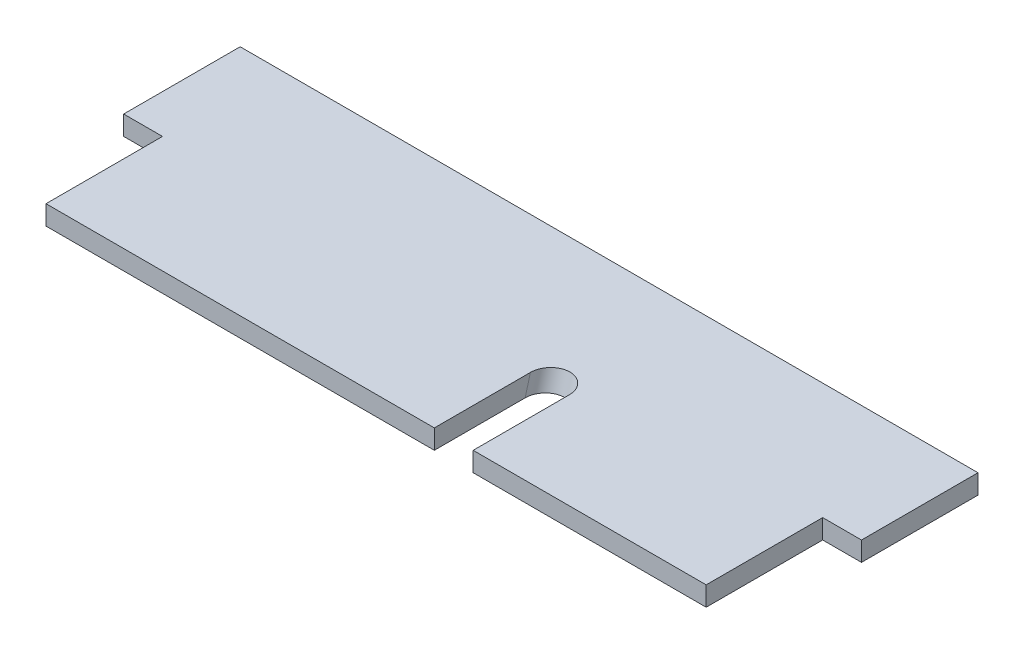
ISO-10303-21;
HEADER;
FILE_DESCRIPTION(('STEP AP214'),'2;1');
FILE_NAME('part.step','',(''),(''),'','','');
FILE_SCHEMA(('AUTOMOTIVE_DESIGN { 1 0 10303 214 1 1 1 1 }'));
ENDSEC;
DATA;
#1=APPLICATION_CONTEXT('core data for automotive mechanical design processes');
#2=APPLICATION_PROTOCOL_DEFINITION('international standard','automotive_design',2000,#1);
#3=PRODUCT_CONTEXT('',#1,'mechanical');
#4=PRODUCT('Part','Part','',(#3));
#5=PRODUCT_RELATED_PRODUCT_CATEGORY('part','',(#4));
#6=PRODUCT_DEFINITION_FORMATION('','',#4);
#7=PRODUCT_DEFINITION_CONTEXT('part definition',#1,'design');
#8=PRODUCT_DEFINITION('design','',#6,#7);
#9=PRODUCT_DEFINITION_SHAPE('','',#8);
#10=(LENGTH_UNIT() NAMED_UNIT(*) SI_UNIT(.MILLI.,.METRE.));
#11=(NAMED_UNIT(*) PLANE_ANGLE_UNIT() SI_UNIT($,.RADIAN.));
#12=(NAMED_UNIT(*) SI_UNIT($,.STERADIAN.) SOLID_ANGLE_UNIT());
#13=UNCERTAINTY_MEASURE_WITH_UNIT(LENGTH_MEASURE(1.E-05),#10,'distance_accuracy_value','');
#14=(GEOMETRIC_REPRESENTATION_CONTEXT(3) GLOBAL_UNCERTAINTY_ASSIGNED_CONTEXT((#13)) GLOBAL_UNIT_ASSIGNED_CONTEXT((#10,
#11,#12)) REPRESENTATION_CONTEXT('',''));
#15=CARTESIAN_POINT('',(0.,0.,0.));
#16=DIRECTION('',(0.,0.,1.));
#17=DIRECTION('',(1.,0.,0.));
#18=AXIS2_PLACEMENT_3D('',#15,#16,#17);
#19=CARTESIAN_POINT('',(-215.9,6.35,76.2));
#20=DIRECTION('',(0.,0.,-1.));
#21=DIRECTION('',(-1.,0.,0.));
#22=AXIS2_PLACEMENT_3D('',#19,#20,#21);
#23=PLANE('',#22);
#24=DIRECTION('',(1.,0.,0.));
#25=VECTOR('',#24,1.);
#26=CARTESIAN_POINT('',(-215.9,-6.35,76.2));
#27=LINE('',#26,#25);
#28=CARTESIAN_POINT('',(-215.9,-6.35,76.2));
#29=VERTEX_POINT('',#28);
#30=CARTESIAN_POINT('',(38.0999999999999,-6.35,76.2));
#31=VERTEX_POINT('',#30);
#32=EDGE_CURVE('E158',#29,#31,#27,.T.);
#33=ORIENTED_EDGE('',*,*,#32,.T.);
#34=DIRECTION('',(0.,-1.,0.));
#35=VECTOR('',#34,1.);
#36=CARTESIAN_POINT('',(38.0999999999999,6.34999999999999,76.2));
#37=LINE('',#36,#35);
#38=CARTESIAN_POINT('',(38.0999999999999,6.34999999999999,76.2));
#39=VERTEX_POINT('',#38);
#40=EDGE_CURVE('E262',#39,#31,#37,.T.);
#41=ORIENTED_EDGE('',*,*,#40,.F.);
#42=DIRECTION('',(1.,0.,0.));
#43=VECTOR('',#42,1.);
#44=CARTESIAN_POINT('',(-215.9,6.35,76.2));
#45=LINE('',#44,#43);
#46=CARTESIAN_POINT('',(-215.9,6.35,76.2));
#47=VERTEX_POINT('',#46);
#48=EDGE_CURVE('E52',#47,#39,#45,.T.);
#49=ORIENTED_EDGE('',*,*,#48,.F.);
#50=DIRECTION('',(0.,-1.,0.));
#51=VECTOR('',#50,1.);
#52=CARTESIAN_POINT('',(-215.9,6.35,76.2));
#53=LINE('',#52,#51);
#54=EDGE_CURVE('E152',#47,#29,#53,.T.);
#55=ORIENTED_EDGE('',*,*,#54,.T.);
#56=EDGE_LOOP('',(#33,#41,#49,#55));
#57=FACE_BOUND('',#56,.T.);
#58=ADVANCED_FACE('F42',(#57),#23,.F.);
#59=CARTESIAN_POINT('',(50.7999999999986,94.7896928963142,-10.6042856199856));
#60=DIRECTION('',(0.,-0.965182723476007,0.261576585923584));
#61=DIRECTION('',(0.,-0.261576585923584,-0.965182723476007));
#62=AXIS2_PLACEMENT_3D('',#59,#60,#61);
#63=CYLINDRICAL_SURFACE('',#62,12.7000000000001);
#64=CARTESIAN_POINT('',(50.7999999999986,6.34999999999999,13.363976933072));
#65=DIRECTION('',(0.,1.,0.));
#66=DIRECTION('',(0.,0.,1.));
#67=AXIS2_PLACEMENT_3D('',#64,#65,#66);
#68=ELLIPSE('',#67,13.1581302597941,12.7000000000001);
#69=CARTESIAN_POINT('',(38.0999999999992,6.34999999999999,13.363976933072));
#70=VERTEX_POINT('',#69);
#71=CARTESIAN_POINT('',(63.4999999999994,6.34999999999999,13.363976933072));
#72=VERTEX_POINT('',#71);
#73=EDGE_CURVE('E46',#70,#72,#68,.F.);
#74=ORIENTED_EDGE('',*,*,#73,.F.);
#75=DIRECTION('',(0.,-0.965182723476007,0.261576585923584));
#76=VECTOR('',#75,1.);
#77=CARTESIAN_POINT('',(38.0999999999992,94.7896928963142,-10.6042856199856));
#78=LINE('',#77,#76);
#79=CARTESIAN_POINT('',(38.0999999999985,-6.34999999999999,16.8058357235667));
#80=VERTEX_POINT('',#79);
#81=EDGE_CURVE('E131',#80,#70,#78,.F.);
#82=ORIENTED_EDGE('',*,*,#81,.F.);
#83=CARTESIAN_POINT('',(50.7999999999986,-6.34999999999999,16.8058357235667));
#84=DIRECTION('',(0.,1.,0.));
#85=DIRECTION('',(0.,0.,1.));
#86=AXIS2_PLACEMENT_3D('',#83,#84,#85);
#87=ELLIPSE('',#86,13.1581302597941,12.7000000000001);
#88=CARTESIAN_POINT('',(63.4999999999987,-6.34999999999999,16.8058357235667));
#89=VERTEX_POINT('',#88);
#90=EDGE_CURVE('E11',#80,#89,#87,.F.);
#91=ORIENTED_EDGE('',*,*,#90,.T.);
#92=DIRECTION('',(0.,-0.965182723476007,0.261576585923584));
#93=VECTOR('',#92,1.);
#94=CARTESIAN_POINT('',(63.4999999999994,94.7896928963142,-10.6042856199856));
#95=LINE('',#94,#93);
#96=EDGE_CURVE('E140',#89,#72,#95,.F.);
#97=ORIENTED_EDGE('',*,*,#96,.T.);
#98=EDGE_LOOP('',(#74,#82,#91,#97));
#99=FACE_BOUND('',#98,.T.);
#100=ADVANCED_FACE('F149',(#99),#63,.F.);
#101=CARTESIAN_POINT('',(215.9,6.35,0.));
#102=DIRECTION('',(-1.,0.,0.));
#103=DIRECTION('',(0.,0.,1.));
#104=AXIS2_PLACEMENT_3D('',#101,#102,#103);
#105=PLANE('',#104);
#106=DIRECTION('',(0.,0.,-1.));
#107=VECTOR('',#106,1.);
#108=CARTESIAN_POINT('',(215.9,-6.35,0.));
#109=LINE('',#108,#107);
#110=CARTESIAN_POINT('',(215.9,-6.35,76.2));
#111=VERTEX_POINT('',#110);
#112=CARTESIAN_POINT('',(215.9,-6.35,0.));
#113=VERTEX_POINT('',#112);
#114=EDGE_CURVE('E175',#111,#113,#109,.T.);
#115=ORIENTED_EDGE('',*,*,#114,.T.);
#116=DIRECTION('',(0.,-1.,0.));
#117=VECTOR('',#116,1.);
#118=CARTESIAN_POINT('',(215.9,6.35,0.));
#119=LINE('',#118,#117);
#120=CARTESIAN_POINT('',(215.9,6.35,0.));
#121=VERTEX_POINT('',#120);
#122=EDGE_CURVE('E197',#121,#113,#119,.T.);
#123=ORIENTED_EDGE('',*,*,#122,.F.);
#124=DIRECTION('',(0.,0.,-1.));
#125=VECTOR('',#124,1.);
#126=CARTESIAN_POINT('',(215.9,6.35,0.));
#127=LINE('',#126,#125);
#128=CARTESIAN_POINT('',(215.9,6.35,76.2));
#129=VERTEX_POINT('',#128);
#130=EDGE_CURVE('E151',#129,#121,#127,.T.);
#131=ORIENTED_EDGE('',*,*,#130,.F.);
#132=DIRECTION('',(0.,-1.,0.));
#133=VECTOR('',#132,1.);
#134=CARTESIAN_POINT('',(215.9,6.35,76.2));
#135=LINE('',#134,#133);
#136=EDGE_CURVE('E171',#129,#111,#135,.T.);
#137=ORIENTED_EDGE('',*,*,#136,.T.);
#138=EDGE_LOOP('',(#115,#123,#131,#137));
#139=FACE_BOUND('',#138,.T.);
#140=ADVANCED_FACE('F292',(#139),#105,.F.);
#141=CARTESIAN_POINT('',(215.9,6.35,0.));
#142=DIRECTION('',(0.,0.,-1.));
#143=DIRECTION('',(-1.,0.,0.));
#144=AXIS2_PLACEMENT_3D('',#141,#142,#143);
#145=PLANE('',#144);
#146=DIRECTION('',(1.,0.,0.));
#147=VECTOR('',#146,1.);
#148=CARTESIAN_POINT('',(215.9,-6.35,0.));
#149=LINE('',#148,#147);
#150=CARTESIAN_POINT('',(241.3,-6.35,0.));
#151=VERTEX_POINT('',#150);
#152=EDGE_CURVE('E174',#113,#151,#149,.T.);
#153=ORIENTED_EDGE('',*,*,#152,.T.);
#154=DIRECTION('',(0.,-1.,0.));
#155=VECTOR('',#154,1.);
#156=CARTESIAN_POINT('',(241.3,6.35,0.));
#157=LINE('',#156,#155);
#158=CARTESIAN_POINT('',(241.3,6.35,0.));
#159=VERTEX_POINT('',#158);
#160=EDGE_CURVE('E192',#159,#151,#157,.T.);
#161=ORIENTED_EDGE('',*,*,#160,.F.);
#162=DIRECTION('',(1.,0.,0.));
#163=VECTOR('',#162,1.);
#164=CARTESIAN_POINT('',(215.9,6.35,0.));
#165=LINE('',#164,#163);
#166=EDGE_CURVE('E156',#121,#159,#165,.T.);
#167=ORIENTED_EDGE('',*,*,#166,.F.);
#168=ORIENTED_EDGE('',*,*,#122,.T.);
#169=EDGE_LOOP('',(#153,#161,#167,#168));
#170=FACE_BOUND('',#169,.T.);
#171=ADVANCED_FACE('F230',(#170),#145,.F.);
#172=CARTESIAN_POINT('',(241.3,6.35,-76.2));
#173=DIRECTION('',(-1.,0.,0.));
#174=DIRECTION('',(0.,0.,1.));
#175=AXIS2_PLACEMENT_3D('',#172,#173,#174);
#176=PLANE('',#175);
#177=DIRECTION('',(0.,0.,-1.));
#178=VECTOR('',#177,1.);
#179=CARTESIAN_POINT('',(241.3,-6.35,-76.2));
#180=LINE('',#179,#178);
#181=CARTESIAN_POINT('',(241.3,-6.35,-76.2));
#182=VERTEX_POINT('',#181);
#183=EDGE_CURVE('E193',#151,#182,#180,.T.);
#184=ORIENTED_EDGE('',*,*,#183,.T.);
#185=DIRECTION('',(0.,-1.,0.));
#186=VECTOR('',#185,1.);
#187=CARTESIAN_POINT('',(241.3,6.35,-76.2));
#188=LINE('',#187,#186);
#189=CARTESIAN_POINT('',(241.3,6.35,-76.2));
#190=VERTEX_POINT('',#189);
#191=EDGE_CURVE('E188',#190,#182,#188,.T.);
#192=ORIENTED_EDGE('',*,*,#191,.F.);
#193=DIRECTION('',(0.,0.,-1.));
#194=VECTOR('',#193,1.);
#195=CARTESIAN_POINT('',(241.3,6.35,-76.2));
#196=LINE('',#195,#194);
#197=EDGE_CURVE('E218',#159,#190,#196,.T.);
#198=ORIENTED_EDGE('',*,*,#197,.F.);
#199=ORIENTED_EDGE('',*,*,#160,.T.);
#200=EDGE_LOOP('',(#184,#192,#198,#199));
#201=FACE_BOUND('',#200,.T.);
#202=ADVANCED_FACE('F235',(#201),#176,.F.);
#203=CARTESIAN_POINT('',(-215.9,6.35,-76.2));
#204=DIRECTION('',(0.,0.,1.));
#205=DIRECTION('',(1.,0.,0.));
#206=AXIS2_PLACEMENT_3D('',#203,#204,#205);
#207=PLANE('',#206);
#208=DIRECTION('',(-1.,0.,0.));
#209=VECTOR('',#208,1.);
#210=CARTESIAN_POINT('',(-215.9,-6.35,-76.2));
#211=LINE('',#210,#209);
#212=CARTESIAN_POINT('',(-241.3,-6.35,-76.2));
#213=VERTEX_POINT('',#212);
#214=EDGE_CURVE('E189',#182,#213,#211,.T.);
#215=ORIENTED_EDGE('',*,*,#214,.T.);
#216=DIRECTION('',(0.,-1.,0.));
#217=VECTOR('',#216,1.);
#218=CARTESIAN_POINT('',(-241.3,6.35,-76.2));
#219=LINE('',#218,#217);
#220=CARTESIAN_POINT('',(-241.3,6.35,-76.2));
#221=VERTEX_POINT('',#220);
#222=EDGE_CURVE('E184',#221,#213,#219,.T.);
#223=ORIENTED_EDGE('',*,*,#222,.F.);
#224=DIRECTION('',(-1.,0.,0.));
#225=VECTOR('',#224,1.);
#226=CARTESIAN_POINT('',(215.9,6.35,-76.2));
#227=LINE('',#226,#225);
#228=EDGE_CURVE('E215',#190,#221,#227,.T.);
#229=ORIENTED_EDGE('',*,*,#228,.F.);
#230=ORIENTED_EDGE('',*,*,#191,.T.);
#231=EDGE_LOOP('',(#215,#223,#229,#230));
#232=FACE_BOUND('',#231,.T.);
#233=ADVANCED_FACE('F242',(#232),#207,.F.);
#234=CARTESIAN_POINT('',(-241.3,6.35,-76.2));
#235=DIRECTION('',(1.,0.,0.));
#236=DIRECTION('',(0.,0.,-1.));
#237=AXIS2_PLACEMENT_3D('',#234,#235,#236);
#238=PLANE('',#237);
#239=DIRECTION('',(0.,0.,1.));
#240=VECTOR('',#239,1.);
#241=CARTESIAN_POINT('',(-241.3,-6.35,-76.2));
#242=LINE('',#241,#240);
#243=CARTESIAN_POINT('',(-241.3,-6.35,0.));
#244=VERTEX_POINT('',#243);
#245=EDGE_CURVE('E185',#213,#244,#242,.T.);
#246=ORIENTED_EDGE('',*,*,#245,.T.);
#247=DIRECTION('',(0.,-1.,0.));
#248=VECTOR('',#247,1.);
#249=CARTESIAN_POINT('',(-241.3,6.35,0.));
#250=LINE('',#249,#248);
#251=CARTESIAN_POINT('',(-241.3,6.35,0.));
#252=VERTEX_POINT('',#251);
#253=EDGE_CURVE('E180',#252,#244,#250,.T.);
#254=ORIENTED_EDGE('',*,*,#253,.F.);
#255=DIRECTION('',(0.,0.,1.));
#256=VECTOR('',#255,1.);
#257=CARTESIAN_POINT('',(-241.3,6.35,-76.2));
#258=LINE('',#257,#256);
#259=EDGE_CURVE('E212',#221,#252,#258,.T.);
#260=ORIENTED_EDGE('',*,*,#259,.F.);
#261=ORIENTED_EDGE('',*,*,#222,.T.);
#262=EDGE_LOOP('',(#246,#254,#260,#261));
#263=FACE_BOUND('',#262,.T.);
#264=ADVANCED_FACE('F250',(#263),#238,.F.);
#265=CARTESIAN_POINT('',(-215.9,6.35,0.));
#266=DIRECTION('',(0.,0.,-1.));
#267=DIRECTION('',(-1.,0.,0.));
#268=AXIS2_PLACEMENT_3D('',#265,#266,#267);
#269=PLANE('',#268);
#270=DIRECTION('',(1.,0.,0.));
#271=VECTOR('',#270,1.);
#272=CARTESIAN_POINT('',(-215.9,-6.35,0.));
#273=LINE('',#272,#271);
#274=CARTESIAN_POINT('',(-215.9,-6.35,0.));
#275=VERTEX_POINT('',#274);
#276=EDGE_CURVE('E181',#244,#275,#273,.T.);
#277=ORIENTED_EDGE('',*,*,#276,.T.);
#278=DIRECTION('',(0.,-1.,0.));
#279=VECTOR('',#278,1.);
#280=CARTESIAN_POINT('',(-215.9,6.35,0.));
#281=LINE('',#280,#279);
#282=CARTESIAN_POINT('',(-215.9,6.35,0.));
#283=VERTEX_POINT('',#282);
#284=EDGE_CURVE('E169',#283,#275,#281,.T.);
#285=ORIENTED_EDGE('',*,*,#284,.F.);
#286=DIRECTION('',(1.,0.,0.));
#287=VECTOR('',#286,1.);
#288=CARTESIAN_POINT('',(-215.9,6.35,0.));
#289=LINE('',#288,#287);
#290=EDGE_CURVE('E209',#252,#283,#289,.T.);
#291=ORIENTED_EDGE('',*,*,#290,.F.);
#292=ORIENTED_EDGE('',*,*,#253,.T.);
#293=EDGE_LOOP('',(#277,#285,#291,#292));
#294=FACE_BOUND('',#293,.T.);
#295=ADVANCED_FACE('F255',(#294),#269,.F.);
#296=CARTESIAN_POINT('',(-215.9,6.35,0.));
#297=DIRECTION('',(1.,0.,0.));
#298=DIRECTION('',(0.,0.,-1.));
#299=AXIS2_PLACEMENT_3D('',#296,#297,#298);
#300=PLANE('',#299);
#301=DIRECTION('',(0.,0.,1.));
#302=VECTOR('',#301,1.);
#303=CARTESIAN_POINT('',(-215.9,-6.35,0.));
#304=LINE('',#303,#302);
#305=EDGE_CURVE('E177',#275,#29,#304,.T.);
#306=ORIENTED_EDGE('',*,*,#305,.T.);
#307=ORIENTED_EDGE('',*,*,#54,.F.);
#308=DIRECTION('',(0.,0.,1.));
#309=VECTOR('',#308,1.);
#310=CARTESIAN_POINT('',(-215.9,6.35,0.));
#311=LINE('',#310,#309);
#312=EDGE_CURVE('E206',#283,#47,#311,.T.);
#313=ORIENTED_EDGE('',*,*,#312,.F.);
#314=ORIENTED_EDGE('',*,*,#284,.T.);
#315=EDGE_LOOP('',(#306,#307,#313,#314));
#316=FACE_BOUND('',#315,.T.);
#317=ADVANCED_FACE('F261',(#316),#300,.F.);
#318=CARTESIAN_POINT('',(63.5000000000001,6.34999999999999,76.2));
#319=VERTEX_POINT('',#318);
#320=EDGE_CURVE('E205',#319,#129,#45,.T.);
#321=ORIENTED_EDGE('',*,*,#320,.F.);
#322=DIRECTION('',(0.,1.,0.));
#323=VECTOR('',#322,1.);
#324=CARTESIAN_POINT('',(63.5000000000001,6.34999999999999,76.2));
#325=LINE('',#324,#323);
#326=CARTESIAN_POINT('',(63.5000000000001,-6.35,76.2));
#327=VERTEX_POINT('',#326);
#328=EDGE_CURVE('E147',#327,#319,#325,.T.);
#329=ORIENTED_EDGE('',*,*,#328,.F.);
#330=EDGE_CURVE('E165',#327,#111,#27,.T.);
#331=ORIENTED_EDGE('',*,*,#330,.T.);
#332=ORIENTED_EDGE('',*,*,#136,.F.);
#333=EDGE_LOOP('',(#321,#329,#331,#332));
#334=FACE_BOUND('',#333,.T.);
#335=ADVANCED_FACE('F288',(#334),#23,.F.);
#336=CARTESIAN_POINT('',(0.,6.35,0.));
#337=DIRECTION('',(0.,1.,0.));
#338=DIRECTION('',(0.,0.,1.));
#339=AXIS2_PLACEMENT_3D('',#336,#337,#338);
#340=PLANE('',#339);
#341=DIRECTION('',(0.,0.,1.));
#342=VECTOR('',#341,1.);
#343=CARTESIAN_POINT('',(38.0999999999999,6.34999999999999,-76.201));
#344=LINE('',#343,#342);
#345=EDGE_CURVE('E134',#70,#39,#344,.T.);
#346=ORIENTED_EDGE('',*,*,#345,.F.);
#347=ORIENTED_EDGE('',*,*,#73,.T.);
#348=DIRECTION('',(0.,0.,1.));
#349=VECTOR('',#348,1.);
#350=CARTESIAN_POINT('',(63.5000000000001,6.34999999999999,-76.201));
#351=LINE('',#350,#349);
#352=EDGE_CURVE('E68',#72,#319,#351,.T.);
#353=ORIENTED_EDGE('',*,*,#352,.T.);
#354=ORIENTED_EDGE('',*,*,#320,.T.);
#355=ORIENTED_EDGE('',*,*,#130,.T.);
#356=ORIENTED_EDGE('',*,*,#166,.T.);
#357=ORIENTED_EDGE('',*,*,#197,.T.);
#358=ORIENTED_EDGE('',*,*,#228,.T.);
#359=ORIENTED_EDGE('',*,*,#259,.T.);
#360=ORIENTED_EDGE('',*,*,#290,.T.);
#361=ORIENTED_EDGE('',*,*,#312,.T.);
#362=ORIENTED_EDGE('',*,*,#48,.T.);
#363=EDGE_LOOP('',(#346,#347,#353,#354,#355,#356,#357,#358,#359,#360,#361,#362));
#364=FACE_BOUND('',#363,.T.);
#365=ADVANCED_FACE('F44',(#364),#340,.T.);
#366=CARTESIAN_POINT('',(0.,-6.35,0.));
#367=DIRECTION('',(0.,1.,0.));
#368=DIRECTION('',(0.,0.,1.));
#369=AXIS2_PLACEMENT_3D('',#366,#367,#368);
#370=PLANE('',#369);
#371=ORIENTED_EDGE('',*,*,#90,.F.);
#372=DIRECTION('',(0.,0.,1.));
#373=VECTOR('',#372,1.);
#374=CARTESIAN_POINT('',(38.0999999999999,-6.35,-76.201));
#375=LINE('',#374,#373);
#376=EDGE_CURVE('E60',#80,#31,#375,.T.);
#377=ORIENTED_EDGE('',*,*,#376,.T.);
#378=ORIENTED_EDGE('',*,*,#32,.F.);
#379=ORIENTED_EDGE('',*,*,#305,.F.);
#380=ORIENTED_EDGE('',*,*,#276,.F.);
#381=ORIENTED_EDGE('',*,*,#245,.F.);
#382=ORIENTED_EDGE('',*,*,#214,.F.);
#383=ORIENTED_EDGE('',*,*,#183,.F.);
#384=ORIENTED_EDGE('',*,*,#152,.F.);
#385=ORIENTED_EDGE('',*,*,#114,.F.);
#386=ORIENTED_EDGE('',*,*,#330,.F.);
#387=DIRECTION('',(0.,0.,1.));
#388=VECTOR('',#387,1.);
#389=CARTESIAN_POINT('',(63.5000000000001,-6.35,-76.201));
#390=LINE('',#389,#388);
#391=EDGE_CURVE('E271',#89,#327,#390,.T.);
#392=ORIENTED_EDGE('',*,*,#391,.F.);
#393=EDGE_LOOP('',(#371,#377,#378,#379,#380,#381,#382,#383,#384,#385,#386,#392));
#394=FACE_BOUND('',#393,.T.);
#395=ADVANCED_FACE('F280',(#394),#370,.F.);
#396=CARTESIAN_POINT('',(63.5000000000001,6.34999999999999,-76.201));
#397=DIRECTION('',(1.,0.,0.));
#398=DIRECTION('',(0.,0.,-1.));
#399=AXIS2_PLACEMENT_3D('',#396,#397,#398);
#400=PLANE('',#399);
#401=ORIENTED_EDGE('',*,*,#391,.T.);
#402=ORIENTED_EDGE('',*,*,#328,.T.);
#403=ORIENTED_EDGE('',*,*,#352,.F.);
#404=ORIENTED_EDGE('',*,*,#96,.F.);
#405=EDGE_LOOP('',(#401,#402,#403,#404));
#406=FACE_BOUND('',#405,.T.);
#407=ADVANCED_FACE('F285',(#406),#400,.F.);
#408=CARTESIAN_POINT('',(38.0999999999999,6.34999999999999,-76.201));
#409=DIRECTION('',(-1.,0.,0.));
#410=DIRECTION('',(0.,0.,1.));
#411=AXIS2_PLACEMENT_3D('',#408,#409,#410);
#412=PLANE('',#411);
#413=ORIENTED_EDGE('',*,*,#81,.T.);
#414=ORIENTED_EDGE('',*,*,#345,.T.);
#415=ORIENTED_EDGE('',*,*,#40,.T.);
#416=ORIENTED_EDGE('',*,*,#376,.F.);
#417=EDGE_LOOP('',(#413,#414,#415,#416));
#418=FACE_BOUND('',#417,.T.);
#419=ADVANCED_FACE('F133',(#418),#412,.F.);
#420=CLOSED_SHELL('',(#58,#100,#140,#171,#202,#233,#264,#295,#317,#335,#365,#395,#407,#419));
#421=MANIFOLD_SOLID_BREP('B2',#420);
#422=ADVANCED_BREP_SHAPE_REPRESENTATION('',(#18,#421),#14);
#423=SHAPE_DEFINITION_REPRESENTATION(#9,#422);
ENDSEC;
END-ISO-10303-21;
